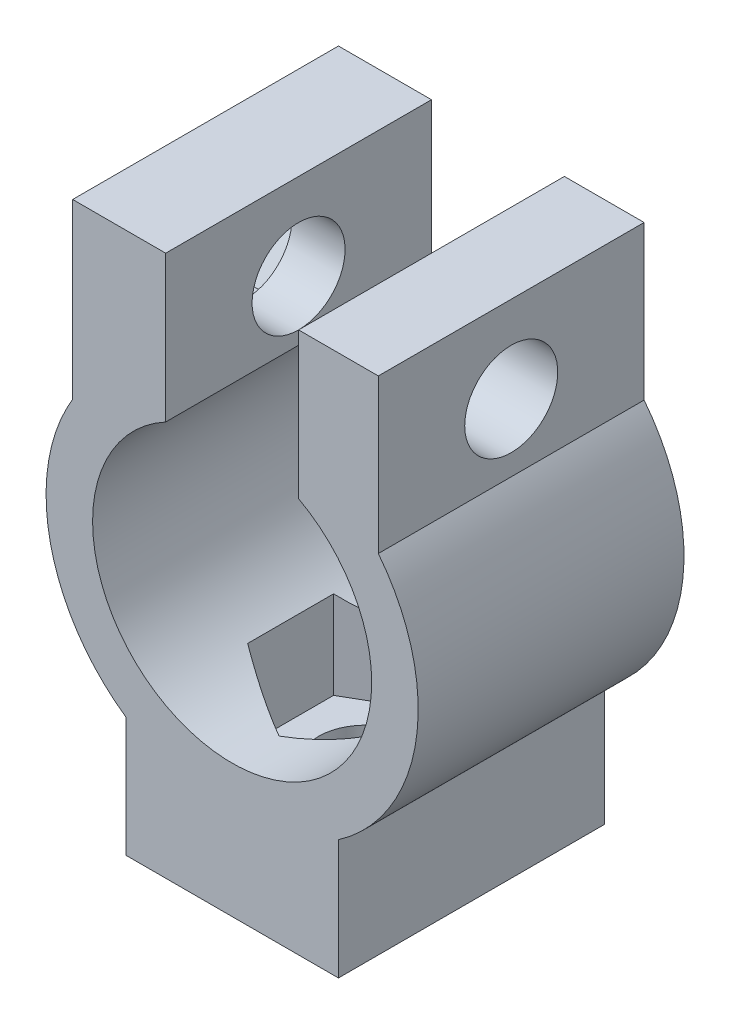
ISO-10303-21;
HEADER;
FILE_DESCRIPTION(('STEP AP214'),'2;1');
FILE_NAME('part.step','',(''),(''),'','','');
FILE_SCHEMA(('AUTOMOTIVE_DESIGN { 1 0 10303 214 1 1 1 1 }'));
ENDSEC;
DATA;
#1=APPLICATION_CONTEXT('core data for automotive mechanical design processes');
#2=APPLICATION_PROTOCOL_DEFINITION('international standard','automotive_design',2000,#1);
#3=PRODUCT_CONTEXT('',#1,'mechanical');
#4=PRODUCT('Part','Part','',(#3));
#5=PRODUCT_RELATED_PRODUCT_CATEGORY('part','',(#4));
#6=PRODUCT_DEFINITION_FORMATION('','',#4);
#7=PRODUCT_DEFINITION_CONTEXT('part definition',#1,'design');
#8=PRODUCT_DEFINITION('design','',#6,#7);
#9=PRODUCT_DEFINITION_SHAPE('','',#8);
#10=(LENGTH_UNIT() NAMED_UNIT(*) SI_UNIT(.MILLI.,.METRE.));
#11=(NAMED_UNIT(*) PLANE_ANGLE_UNIT() SI_UNIT($,.RADIAN.));
#12=(NAMED_UNIT(*) SI_UNIT($,.STERADIAN.) SOLID_ANGLE_UNIT());
#13=UNCERTAINTY_MEASURE_WITH_UNIT(LENGTH_MEASURE(1.E-05),#10,'distance_accuracy_value','');
#14=(GEOMETRIC_REPRESENTATION_CONTEXT(3) GLOBAL_UNCERTAINTY_ASSIGNED_CONTEXT((#13)) GLOBAL_UNIT_ASSIGNED_CONTEXT((#10,
#11,#12)) REPRESENTATION_CONTEXT('',''));
#15=CARTESIAN_POINT('',(0.,0.,0.));
#16=DIRECTION('',(0.,0.,1.));
#17=DIRECTION('',(1.,0.,0.));
#18=AXIS2_PLACEMENT_3D('',#15,#16,#17);
#19=CARTESIAN_POINT('',(-7.,17.1165463281549,0.));
#20=DIRECTION('',(1.,0.,0.));
#21=DIRECTION('',(0.,1.,0.));
#22=AXIS2_PLACEMENT_3D('',#19,#20,#21);
#23=CYLINDRICAL_SURFACE('',#22,1.75);
#24=CARTESIAN_POINT('',(-2.5,17.1165463281549,0.));
#25=DIRECTION('',(-1.,0.,0.));
#26=DIRECTION('',(0.,-1.,0.));
#27=AXIS2_PLACEMENT_3D('',#24,#25,#26);
#28=CIRCLE('',#27,1.75);
#29=CARTESIAN_POINT('',(-2.5,15.3665463281549,0.));
#30=VERTEX_POINT('',#29);
#31=EDGE_CURVE('E263',#30,#30,#28,.T.);
#32=ORIENTED_EDGE('',*,*,#31,.F.);
#33=EDGE_LOOP('',(#32));
#34=FACE_BOUND('',#33,.T.);
#35=CARTESIAN_POINT('',(-4.50000000000001,17.1165463281549,0.));
#36=DIRECTION('',(-1.,0.,0.));
#37=DIRECTION('',(0.,-1.,0.));
#38=AXIS2_PLACEMENT_3D('',#35,#36,#37);
#39=CIRCLE('',#38,1.75);
#40=CARTESIAN_POINT('',(-4.50000000000001,15.3665463281549,0.));
#41=VERTEX_POINT('',#40);
#42=EDGE_CURVE('E222',#41,#41,#39,.F.);
#43=ORIENTED_EDGE('',*,*,#42,.F.);
#44=EDGE_LOOP('',(#43));
#45=FACE_BOUND('',#44,.T.);
#46=ADVANCED_FACE('F35',(#34,#45),#23,.F.);
#47=CARTESIAN_POINT('',(0.,10.25,5.));
#48=DIRECTION('',(0.,0.,-1.));
#49=DIRECTION('',(-1.,0.,0.));
#50=AXIS2_PLACEMENT_3D('',#47,#48,#49);
#51=CYLINDRICAL_SURFACE('',#50,7.);
#52=CARTESIAN_POINT('',(0.,10.25,5.));
#53=DIRECTION('',(0.,0.,1.));
#54=DIRECTION('',(-1.,0.,0.));
#55=AXIS2_PLACEMENT_3D('',#52,#53,#54);
#56=CIRCLE('',#55,7.);
#57=CARTESIAN_POINT('',(-6.00000000000001,13.855551275464,5.));
#58=VERTEX_POINT('',#57);
#59=CARTESIAN_POINT('',(-4.,4.50543735346197,5.));
#60=VERTEX_POINT('',#59);
#61=EDGE_CURVE('E51',#58,#60,#56,.T.);
#62=ORIENTED_EDGE('',*,*,#61,.F.);
#63=DIRECTION('',(0.,0.,-1.));
#64=VECTOR('',#63,1.);
#65=CARTESIAN_POINT('',(-6.00000000000001,13.855551275464,5.));
#66=LINE('',#65,#64);
#67=CARTESIAN_POINT('',(-6.00000000000001,13.855551275464,-5.));
#68=VERTEX_POINT('',#67);
#69=EDGE_CURVE('E55',#58,#68,#66,.T.);
#70=ORIENTED_EDGE('',*,*,#69,.T.);
#71=CARTESIAN_POINT('',(0.,10.25,-5.));
#72=DIRECTION('',(0.,0.,1.));
#73=DIRECTION('',(-1.,0.,0.));
#74=AXIS2_PLACEMENT_3D('',#71,#72,#73);
#75=CIRCLE('',#74,7.);
#76=CARTESIAN_POINT('',(-4.,4.50543735346197,-5.));
#77=VERTEX_POINT('',#76);
#78=EDGE_CURVE('E345',#68,#77,#75,.T.);
#79=ORIENTED_EDGE('',*,*,#78,.T.);
#80=DIRECTION('',(0.,0.,-1.));
#81=VECTOR('',#80,1.);
#82=CARTESIAN_POINT('',(-4.,4.50543735346197,5.));
#83=LINE('',#82,#81);
#84=EDGE_CURVE('E355',#60,#77,#83,.T.);
#85=ORIENTED_EDGE('',*,*,#84,.F.);
#86=EDGE_LOOP('',(#62,#70,#79,#85));
#87=FACE_BOUND('',#86,.T.);
#88=ADVANCED_FACE('F434',(#87),#51,.T.);
#89=CARTESIAN_POINT('',(4.,0.,5.));
#90=DIRECTION('',(-1.,0.,0.));
#91=DIRECTION('',(0.,0.,1.));
#92=AXIS2_PLACEMENT_3D('',#89,#90,#91);
#93=PLANE('',#92);
#94=DIRECTION('',(0.,1.,0.));
#95=VECTOR('',#94,1.);
#96=CARTESIAN_POINT('',(4.,0.,-5.));
#97=LINE('',#96,#95);
#98=CARTESIAN_POINT('',(4.,0.,-5.));
#99=VERTEX_POINT('',#98);
#100=CARTESIAN_POINT('',(4.,4.50543735346197,-5.));
#101=VERTEX_POINT('',#100);
#102=EDGE_CURVE('E304',#99,#101,#97,.T.);
#103=ORIENTED_EDGE('',*,*,#102,.T.);
#104=DIRECTION('',(0.,0.,-1.));
#105=VECTOR('',#104,1.);
#106=CARTESIAN_POINT('',(4.,4.50543735346197,5.));
#107=LINE('',#106,#105);
#108=CARTESIAN_POINT('',(4.,4.50543735346197,5.));
#109=VERTEX_POINT('',#108);
#110=EDGE_CURVE('E376',#109,#101,#107,.T.);
#111=ORIENTED_EDGE('',*,*,#110,.F.);
#112=DIRECTION('',(0.,1.,0.));
#113=VECTOR('',#112,1.);
#114=CARTESIAN_POINT('',(4.,0.,5.));
#115=LINE('',#114,#113);
#116=CARTESIAN_POINT('',(4.,0.,5.));
#117=VERTEX_POINT('',#116);
#118=EDGE_CURVE('E305',#117,#109,#115,.T.);
#119=ORIENTED_EDGE('',*,*,#118,.F.);
#120=DIRECTION('',(0.,0.,-1.));
#121=VECTOR('',#120,1.);
#122=CARTESIAN_POINT('',(4.,0.,5.));
#123=LINE('',#122,#121);
#124=EDGE_CURVE('E328',#117,#99,#123,.T.);
#125=ORIENTED_EDGE('',*,*,#124,.T.);
#126=EDGE_LOOP('',(#103,#111,#119,#125));
#127=FACE_BOUND('',#126,.T.);
#128=ADVANCED_FACE('F37',(#127),#93,.F.);
#129=CARTESIAN_POINT('',(0.,10.25,5.));
#130=DIRECTION('',(0.,0.,-1.));
#131=DIRECTION('',(-1.,0.,0.));
#132=AXIS2_PLACEMENT_3D('',#129,#130,#131);
#133=CYLINDRICAL_SURFACE('',#132,7.);
#134=CARTESIAN_POINT('',(0.,10.25,-5.));
#135=DIRECTION('',(0.,0.,1.));
#136=DIRECTION('',(1.,0.,0.));
#137=AXIS2_PLACEMENT_3D('',#134,#135,#136);
#138=CIRCLE('',#137,7.);
#139=CARTESIAN_POINT('',(5.5,14.5801270189222,-5.));
#140=VERTEX_POINT('',#139);
#141=EDGE_CURVE('E331',#101,#140,#138,.T.);
#142=ORIENTED_EDGE('',*,*,#141,.T.);
#143=DIRECTION('',(0.,0.,-1.));
#144=VECTOR('',#143,1.);
#145=CARTESIAN_POINT('',(5.5,14.5801270189222,5.));
#146=LINE('',#145,#144);
#147=CARTESIAN_POINT('',(5.5,14.5801270189222,5.));
#148=VERTEX_POINT('',#147);
#149=EDGE_CURVE('E373',#148,#140,#146,.T.);
#150=ORIENTED_EDGE('',*,*,#149,.F.);
#151=CARTESIAN_POINT('',(0.,10.25,5.));
#152=DIRECTION('',(0.,0.,1.));
#153=DIRECTION('',(1.,0.,0.));
#154=AXIS2_PLACEMENT_3D('',#151,#152,#153);
#155=CIRCLE('',#154,7.);
#156=EDGE_CURVE('E308',#109,#148,#155,.T.);
#157=ORIENTED_EDGE('',*,*,#156,.F.);
#158=ORIENTED_EDGE('',*,*,#110,.T.);
#159=EDGE_LOOP('',(#142,#150,#157,#158));
#160=FACE_BOUND('',#159,.T.);
#161=ADVANCED_FACE('F463',(#160),#133,.T.);
#162=CARTESIAN_POINT('',(5.5,20.3665463281549,5.));
#163=DIRECTION('',(-1.,0.,0.));
#164=DIRECTION('',(0.,0.,1.));
#165=AXIS2_PLACEMENT_3D('',#162,#163,#164);
#166=PLANE('',#165);
#167=CARTESIAN_POINT('',(5.5,17.1165463281549,0.));
#168=DIRECTION('',(-1.,0.,0.));
#169=DIRECTION('',(0.,0.,1.));
#170=AXIS2_PLACEMENT_3D('',#167,#168,#169);
#171=CIRCLE('',#170,1.75);
#172=CARTESIAN_POINT('',(5.5,17.1165463281549,1.75));
#173=VERTEX_POINT('',#172);
#174=EDGE_CURVE('E269',#173,#173,#171,.T.);
#175=ORIENTED_EDGE('',*,*,#174,.T.);
#176=EDGE_LOOP('',(#175));
#177=FACE_BOUND('',#176,.T.);
#178=DIRECTION('',(0.,1.,0.));
#179=VECTOR('',#178,1.);
#180=CARTESIAN_POINT('',(5.5,20.3665463281549,-5.));
#181=LINE('',#180,#179);
#182=CARTESIAN_POINT('',(5.5,20.3665463281549,-5.));
#183=VERTEX_POINT('',#182);
#184=EDGE_CURVE('E333',#140,#183,#181,.T.);
#185=ORIENTED_EDGE('',*,*,#184,.T.);
#186=DIRECTION('',(0.,0.,-1.));
#187=VECTOR('',#186,1.);
#188=CARTESIAN_POINT('',(5.5,20.3665463281549,5.));
#189=LINE('',#188,#187);
#190=CARTESIAN_POINT('',(5.5,20.3665463281549,5.));
#191=VERTEX_POINT('',#190);
#192=EDGE_CURVE('E370',#191,#183,#189,.T.);
#193=ORIENTED_EDGE('',*,*,#192,.F.);
#194=DIRECTION('',(0.,1.,0.));
#195=VECTOR('',#194,1.);
#196=CARTESIAN_POINT('',(5.5,20.3665463281549,5.));
#197=LINE('',#196,#195);
#198=EDGE_CURVE('E311',#148,#191,#197,.T.);
#199=ORIENTED_EDGE('',*,*,#198,.F.);
#200=ORIENTED_EDGE('',*,*,#149,.T.);
#201=EDGE_LOOP('',(#185,#193,#199,#200));
#202=FACE_BOUND('',#201,.T.);
#203=ADVANCED_FACE('F459',(#177,#202),#166,.F.);
#204=CARTESIAN_POINT('',(2.5,20.3665463281549,5.));
#205=DIRECTION('',(0.,-1.,0.));
#206=DIRECTION('',(0.,0.,-1.));
#207=AXIS2_PLACEMENT_3D('',#204,#205,#206);
#208=PLANE('',#207);
#209=DIRECTION('',(-1.,0.,0.));
#210=VECTOR('',#209,1.);
#211=CARTESIAN_POINT('',(2.5,20.3665463281549,-5.));
#212=LINE('',#211,#210);
#213=CARTESIAN_POINT('',(2.5,20.3665463281549,-5.));
#214=VERTEX_POINT('',#213);
#215=EDGE_CURVE('E335',#183,#214,#212,.T.);
#216=ORIENTED_EDGE('',*,*,#215,.T.);
#217=DIRECTION('',(0.,0.,-1.));
#218=VECTOR('',#217,1.);
#219=CARTESIAN_POINT('',(2.5,20.3665463281549,5.));
#220=LINE('',#219,#218);
#221=CARTESIAN_POINT('',(2.5,20.3665463281549,5.));
#222=VERTEX_POINT('',#221);
#223=EDGE_CURVE('E367',#222,#214,#220,.T.);
#224=ORIENTED_EDGE('',*,*,#223,.F.);
#225=DIRECTION('',(-1.,0.,0.));
#226=VECTOR('',#225,1.);
#227=CARTESIAN_POINT('',(2.5,20.3665463281549,5.));
#228=LINE('',#227,#226);
#229=EDGE_CURVE('E313',#191,#222,#228,.T.);
#230=ORIENTED_EDGE('',*,*,#229,.F.);
#231=ORIENTED_EDGE('',*,*,#192,.T.);
#232=EDGE_LOOP('',(#216,#224,#230,#231));
#233=FACE_BOUND('',#232,.T.);
#234=ADVANCED_FACE('F462',(#233),#208,.F.);
#235=CARTESIAN_POINT('',(2.5,14.8665463281548,5.));
#236=DIRECTION('',(1.,0.,0.));
#237=DIRECTION('',(0.,1.,0.));
#238=AXIS2_PLACEMENT_3D('',#235,#236,#237);
#239=PLANE('',#238);
#240=CARTESIAN_POINT('',(2.5,17.1165463281549,0.));
#241=DIRECTION('',(1.,0.,0.));
#242=DIRECTION('',(0.,1.,0.));
#243=AXIS2_PLACEMENT_3D('',#240,#241,#242);
#244=CIRCLE('',#243,1.75);
#245=CARTESIAN_POINT('',(2.5,18.8665463281549,0.));
#246=VERTEX_POINT('',#245);
#247=EDGE_CURVE('E266',#246,#246,#244,.T.);
#248=ORIENTED_EDGE('',*,*,#247,.T.);
#249=EDGE_LOOP('',(#248));
#250=FACE_BOUND('',#249,.T.);
#251=DIRECTION('',(0.,-1.,0.));
#252=VECTOR('',#251,1.);
#253=CARTESIAN_POINT('',(2.5,14.8665463281548,-5.));
#254=LINE('',#253,#252);
#255=CARTESIAN_POINT('',(2.5,14.8665463281548,-5.));
#256=VERTEX_POINT('',#255);
#257=EDGE_CURVE('E337',#214,#256,#254,.T.);
#258=ORIENTED_EDGE('',*,*,#257,.T.);
#259=DIRECTION('',(0.,0.,-1.));
#260=VECTOR('',#259,1.);
#261=CARTESIAN_POINT('',(2.5,14.8665463281548,5.));
#262=LINE('',#261,#260);
#263=CARTESIAN_POINT('',(2.5,14.8665463281548,5.));
#264=VERTEX_POINT('',#263);
#265=EDGE_CURVE('E364',#264,#256,#262,.T.);
#266=ORIENTED_EDGE('',*,*,#265,.F.);
#267=DIRECTION('',(0.,-1.,0.));
#268=VECTOR('',#267,1.);
#269=CARTESIAN_POINT('',(2.5,14.8665463281548,5.));
#270=LINE('',#269,#268);
#271=EDGE_CURVE('E315',#222,#264,#270,.T.);
#272=ORIENTED_EDGE('',*,*,#271,.F.);
#273=ORIENTED_EDGE('',*,*,#223,.T.);
#274=EDGE_LOOP('',(#258,#266,#272,#273));
#275=FACE_BOUND('',#274,.T.);
#276=ADVANCED_FACE('F480',(#250,#275),#239,.F.);
#277=CARTESIAN_POINT('',(0.,10.25,5.));
#278=DIRECTION('',(0.,0.,-1.));
#279=DIRECTION('',(-1.,0.,0.));
#280=AXIS2_PLACEMENT_3D('',#277,#278,#279);
#281=CYLINDRICAL_SURFACE('',#280,5.25);
#282=CARTESIAN_POINT('',(0.,10.25,-3.2331615074619));
#283=DIRECTION('',(-0.5,0.,-0.866025403784439));
#284=DIRECTION('',(0.866025403784439,0.,-0.5));
#285=AXIS2_PLACEMENT_3D('',#282,#283,#284);
#286=ELLIPSE('',#285,6.06217782649107,5.25);
#287=CARTESIAN_POINT('',(-2.79999999999998,5.80899786084265,-1.61658075373095));
#288=VERTEX_POINT('',#287);
#289=CARTESIAN_POINT('',(0.,4.99999999999999,-3.2331615074619));
#290=VERTEX_POINT('',#289);
#291=EDGE_CURVE('E379',#288,#290,#286,.F.);
#292=ORIENTED_EDGE('',*,*,#291,.T.);
#293=CARTESIAN_POINT('',(0.,10.25,-3.23316150746191));
#294=DIRECTION('',(0.5,0.,-0.866025403784439));
#295=DIRECTION('',(-0.866025403784439,0.,-0.5));
#296=AXIS2_PLACEMENT_3D('',#293,#294,#295);
#297=ELLIPSE('',#296,6.06217782649107,5.25);
#298=CARTESIAN_POINT('',(2.80000000000002,5.80899786084268,-1.61658075373095));
#299=VERTEX_POINT('',#298);
#300=EDGE_CURVE('E12',#290,#299,#297,.F.);
#301=ORIENTED_EDGE('',*,*,#300,.T.);
#302=DIRECTION('',(0.,0.,-1.));
#303=VECTOR('',#302,1.);
#304=CARTESIAN_POINT('',(2.80000000000002,5.80899786084268,5.));
#305=LINE('',#304,#303);
#306=CARTESIAN_POINT('',(2.80000000000002,5.80899786084268,1.61658075373095));
#307=VERTEX_POINT('',#306);
#308=EDGE_CURVE('E44',#299,#307,#305,.F.);
#309=ORIENTED_EDGE('',*,*,#308,.T.);
#310=CARTESIAN_POINT('',(0.,10.25,3.23316150746191));
#311=DIRECTION('',(0.5,0.,0.866025403784439));
#312=DIRECTION('',(0.866025403784439,0.,-0.5));
#313=AXIS2_PLACEMENT_3D('',#310,#311,#312);
#314=ELLIPSE('',#313,6.06217782649107,5.25);
#315=CARTESIAN_POINT('',(0.,5.,3.2331615074619));
#316=VERTEX_POINT('',#315);
#317=EDGE_CURVE('E388',#307,#316,#314,.F.);
#318=ORIENTED_EDGE('',*,*,#317,.T.);
#319=CARTESIAN_POINT('',(0.,10.25,3.2331615074619));
#320=DIRECTION('',(-0.5,0.,0.866025403784439));
#321=DIRECTION('',(-0.866025403784439,0.,-0.5));
#322=AXIS2_PLACEMENT_3D('',#319,#320,#321);
#323=ELLIPSE('',#322,6.06217782649107,5.25);
#324=CARTESIAN_POINT('',(-2.79999999999998,5.80899786084266,1.61658075373095));
#325=VERTEX_POINT('',#324);
#326=EDGE_CURVE('E385',#316,#325,#323,.F.);
#327=ORIENTED_EDGE('',*,*,#326,.T.);
#328=DIRECTION('',(0.,0.,-1.));
#329=VECTOR('',#328,1.);
#330=CARTESIAN_POINT('',(-2.79999999999998,5.80899786084266,5.));
#331=LINE('',#330,#329);
#332=EDGE_CURVE('E382',#325,#288,#331,.T.);
#333=ORIENTED_EDGE('',*,*,#332,.T.);
#334=EDGE_LOOP('',(#292,#301,#309,#318,#327,#333));
#335=FACE_BOUND('',#334,.T.);
#336=CARTESIAN_POINT('',(0.,10.25,-5.));
#337=DIRECTION('',(0.,0.,-1.));
#338=DIRECTION('',(1.,0.,0.));
#339=AXIS2_PLACEMENT_3D('',#336,#337,#338);
#340=CIRCLE('',#339,5.25);
#341=CARTESIAN_POINT('',(-2.5,14.8665463281548,-5.));
#342=VERTEX_POINT('',#341);
#343=EDGE_CURVE('E339',#256,#342,#340,.T.);
#344=ORIENTED_EDGE('',*,*,#343,.T.);
#345=DIRECTION('',(0.,0.,-1.));
#346=VECTOR('',#345,1.);
#347=CARTESIAN_POINT('',(-2.5,14.8665463281548,5.));
#348=LINE('',#347,#346);
#349=CARTESIAN_POINT('',(-2.5,14.8665463281548,5.));
#350=VERTEX_POINT('',#349);
#351=EDGE_CURVE('E361',#350,#342,#348,.T.);
#352=ORIENTED_EDGE('',*,*,#351,.F.);
#353=CARTESIAN_POINT('',(0.,10.25,5.));
#354=DIRECTION('',(0.,0.,-1.));
#355=DIRECTION('',(1.,0.,0.));
#356=AXIS2_PLACEMENT_3D('',#353,#354,#355);
#357=CIRCLE('',#356,5.25);
#358=EDGE_CURVE('E317',#264,#350,#357,.T.);
#359=ORIENTED_EDGE('',*,*,#358,.F.);
#360=ORIENTED_EDGE('',*,*,#265,.T.);
#361=EDGE_LOOP('',(#344,#352,#359,#360));
#362=FACE_BOUND('',#361,.T.);
#363=ADVANCED_FACE('F393',(#335,#362),#281,.F.);
#364=CARTESIAN_POINT('',(-2.5,14.8665463281548,5.));
#365=DIRECTION('',(-1.,0.,0.));
#366=DIRECTION('',(0.,-1.,0.));
#367=AXIS2_PLACEMENT_3D('',#364,#365,#366);
#368=PLANE('',#367);
#369=ORIENTED_EDGE('',*,*,#31,.T.);
#370=EDGE_LOOP('',(#369));
#371=FACE_BOUND('',#370,.T.);
#372=DIRECTION('',(0.,1.,0.));
#373=VECTOR('',#372,1.);
#374=CARTESIAN_POINT('',(-2.5,14.8665463281548,-5.));
#375=LINE('',#374,#373);
#376=CARTESIAN_POINT('',(-2.5,20.3665463281549,-5.));
#377=VERTEX_POINT('',#376);
#378=EDGE_CURVE('E341',#342,#377,#375,.T.);
#379=ORIENTED_EDGE('',*,*,#378,.T.);
#380=DIRECTION('',(0.,0.,-1.));
#381=VECTOR('',#380,1.);
#382=CARTESIAN_POINT('',(-2.5,20.3665463281549,5.));
#383=LINE('',#382,#381);
#384=CARTESIAN_POINT('',(-2.5,20.3665463281549,5.));
#385=VERTEX_POINT('',#384);
#386=EDGE_CURVE('E358',#385,#377,#383,.T.);
#387=ORIENTED_EDGE('',*,*,#386,.F.);
#388=DIRECTION('',(0.,1.,0.));
#389=VECTOR('',#388,1.);
#390=CARTESIAN_POINT('',(-2.5,14.8665463281548,5.));
#391=LINE('',#390,#389);
#392=EDGE_CURVE('E319',#350,#385,#391,.T.);
#393=ORIENTED_EDGE('',*,*,#392,.F.);
#394=ORIENTED_EDGE('',*,*,#351,.T.);
#395=EDGE_LOOP('',(#379,#387,#393,#394));
#396=FACE_BOUND('',#395,.T.);
#397=ADVANCED_FACE('F512',(#371,#396),#368,.F.);
#398=CARTESIAN_POINT('',(-2.5,20.3665463281549,5.));
#399=DIRECTION('',(0.,-1.,0.));
#400=DIRECTION('',(0.,0.,-1.));
#401=AXIS2_PLACEMENT_3D('',#398,#399,#400);
#402=PLANE('',#401);
#403=DIRECTION('',(-1.,0.,0.));
#404=VECTOR('',#403,1.);
#405=CARTESIAN_POINT('',(-2.5,20.3665463281549,-5.));
#406=LINE('',#405,#404);
#407=CARTESIAN_POINT('',(-6.00000000000001,20.3665463281548,-5.));
#408=VERTEX_POINT('',#407);
#409=EDGE_CURVE('E343',#377,#408,#406,.T.);
#410=ORIENTED_EDGE('',*,*,#409,.T.);
#411=DIRECTION('',(0.,0.,-1.));
#412=VECTOR('',#411,1.);
#413=CARTESIAN_POINT('',(-6.00000000000001,20.3665463281548,-5.));
#414=LINE('',#413,#412);
#415=CARTESIAN_POINT('',(-6.00000000000001,20.3665463281548,5.));
#416=VERTEX_POINT('',#415);
#417=EDGE_CURVE('E259',#416,#408,#414,.T.);
#418=ORIENTED_EDGE('',*,*,#417,.F.);
#419=DIRECTION('',(-1.,0.,0.));
#420=VECTOR('',#419,1.);
#421=CARTESIAN_POINT('',(-2.5,20.3665463281549,5.));
#422=LINE('',#421,#420);
#423=EDGE_CURVE('E321',#385,#416,#422,.T.);
#424=ORIENTED_EDGE('',*,*,#423,.F.);
#425=ORIENTED_EDGE('',*,*,#386,.T.);
#426=EDGE_LOOP('',(#410,#418,#424,#425));
#427=FACE_BOUND('',#426,.T.);
#428=ADVANCED_FACE('F510',(#427),#402,.F.);
#429=CARTESIAN_POINT('',(-4.,0.,5.));
#430=DIRECTION('',(1.,0.,0.));
#431=DIRECTION('',(0.,0.,-1.));
#432=AXIS2_PLACEMENT_3D('',#429,#430,#431);
#433=PLANE('',#432);
#434=DIRECTION('',(0.,-1.,0.));
#435=VECTOR('',#434,1.);
#436=CARTESIAN_POINT('',(-4.,0.,-5.));
#437=LINE('',#436,#435);
#438=CARTESIAN_POINT('',(-4.,0.,-5.));
#439=VERTEX_POINT('',#438);
#440=EDGE_CURVE('E347',#77,#439,#437,.T.);
#441=ORIENTED_EDGE('',*,*,#440,.T.);
#442=DIRECTION('',(0.,0.,-1.));
#443=VECTOR('',#442,1.);
#444=CARTESIAN_POINT('',(-4.,0.,5.));
#445=LINE('',#444,#443);
#446=CARTESIAN_POINT('',(-4.,0.,5.));
#447=VERTEX_POINT('',#446);
#448=EDGE_CURVE('E352',#447,#439,#445,.T.);
#449=ORIENTED_EDGE('',*,*,#448,.F.);
#450=DIRECTION('',(0.,-1.,0.));
#451=VECTOR('',#450,1.);
#452=CARTESIAN_POINT('',(-4.,0.,5.));
#453=LINE('',#452,#451);
#454=EDGE_CURVE('E324',#60,#447,#453,.T.);
#455=ORIENTED_EDGE('',*,*,#454,.F.);
#456=ORIENTED_EDGE('',*,*,#84,.T.);
#457=EDGE_LOOP('',(#441,#449,#455,#456));
#458=FACE_BOUND('',#457,.T.);
#459=ADVANCED_FACE('F503',(#458),#433,.F.);
#460=CARTESIAN_POINT('',(-4.,0.,5.));
#461=DIRECTION('',(0.,1.,0.));
#462=DIRECTION('',(0.,0.,1.));
#463=AXIS2_PLACEMENT_3D('',#460,#461,#462);
#464=PLANE('',#463);
#465=CARTESIAN_POINT('',(0.,0.,0.));
#466=DIRECTION('',(0.,1.,0.));
#467=DIRECTION('',(-1.,0.,0.));
#468=AXIS2_PLACEMENT_3D('',#465,#466,#467);
#469=CIRCLE('',#468,1.75);
#470=CARTESIAN_POINT('',(-1.74999999999997,0.,0.));
#471=VERTEX_POINT('',#470);
#472=EDGE_CURVE('E272',#471,#471,#469,.T.);
#473=ORIENTED_EDGE('',*,*,#472,.T.);
#474=EDGE_LOOP('',(#473));
#475=FACE_BOUND('',#474,.T.);
#476=DIRECTION('',(1.,0.,0.));
#477=VECTOR('',#476,1.);
#478=CARTESIAN_POINT('',(-4.,0.,-5.));
#479=LINE('',#478,#477);
#480=EDGE_CURVE('E309',#439,#99,#479,.T.);
#481=ORIENTED_EDGE('',*,*,#480,.T.);
#482=ORIENTED_EDGE('',*,*,#124,.F.);
#483=DIRECTION('',(1.,0.,0.));
#484=VECTOR('',#483,1.);
#485=CARTESIAN_POINT('',(-4.,0.,5.));
#486=LINE('',#485,#484);
#487=EDGE_CURVE('E326',#447,#117,#486,.T.);
#488=ORIENTED_EDGE('',*,*,#487,.F.);
#489=ORIENTED_EDGE('',*,*,#448,.T.);
#490=EDGE_LOOP('',(#481,#482,#488,#489));
#491=FACE_BOUND('',#490,.T.);
#492=ADVANCED_FACE('F499',(#475,#491),#464,.F.);
#493=CARTESIAN_POINT('',(0.,10.25,5.));
#494=DIRECTION('',(0.,0.,1.));
#495=DIRECTION('',(1.,0.,0.));
#496=AXIS2_PLACEMENT_3D('',#493,#494,#495);
#497=PLANE('',#496);
#498=DIRECTION('',(0.,1.,0.));
#499=VECTOR('',#498,1.);
#500=CARTESIAN_POINT('',(-6.00000000000001,20.3665463281548,5.));
#501=LINE('',#500,#499);
#502=EDGE_CURVE('E256',#58,#416,#501,.T.);
#503=ORIENTED_EDGE('',*,*,#502,.F.);
#504=ORIENTED_EDGE('',*,*,#61,.T.);
#505=ORIENTED_EDGE('',*,*,#454,.T.);
#506=ORIENTED_EDGE('',*,*,#487,.T.);
#507=ORIENTED_EDGE('',*,*,#118,.T.);
#508=ORIENTED_EDGE('',*,*,#156,.T.);
#509=ORIENTED_EDGE('',*,*,#198,.T.);
#510=ORIENTED_EDGE('',*,*,#229,.T.);
#511=ORIENTED_EDGE('',*,*,#271,.T.);
#512=ORIENTED_EDGE('',*,*,#358,.T.);
#513=ORIENTED_EDGE('',*,*,#392,.T.);
#514=ORIENTED_EDGE('',*,*,#423,.T.);
#515=EDGE_LOOP('',(#503,#504,#505,#506,#507,#508,#509,#510,#511,#512,#513,#514));
#516=FACE_BOUND('',#515,.T.);
#517=ADVANCED_FACE('F487',(#516),#497,.T.);
#518=CARTESIAN_POINT('',(0.,10.25,-5.));
#519=DIRECTION('',(0.,0.,1.));
#520=DIRECTION('',(1.,0.,0.));
#521=AXIS2_PLACEMENT_3D('',#518,#519,#520);
#522=PLANE('',#521);
#523=ORIENTED_EDGE('',*,*,#78,.F.);
#524=DIRECTION('',(0.,-1.,0.));
#525=VECTOR('',#524,1.);
#526=CARTESIAN_POINT('',(-6.00000000000001,20.3665463281548,-5.));
#527=LINE('',#526,#525);
#528=EDGE_CURVE('E253',#408,#68,#527,.T.);
#529=ORIENTED_EDGE('',*,*,#528,.F.);
#530=ORIENTED_EDGE('',*,*,#409,.F.);
#531=ORIENTED_EDGE('',*,*,#378,.F.);
#532=ORIENTED_EDGE('',*,*,#343,.F.);
#533=ORIENTED_EDGE('',*,*,#257,.F.);
#534=ORIENTED_EDGE('',*,*,#215,.F.);
#535=ORIENTED_EDGE('',*,*,#184,.F.);
#536=ORIENTED_EDGE('',*,*,#141,.F.);
#537=ORIENTED_EDGE('',*,*,#102,.F.);
#538=ORIENTED_EDGE('',*,*,#480,.F.);
#539=ORIENTED_EDGE('',*,*,#440,.F.);
#540=EDGE_LOOP('',(#523,#529,#530,#531,#532,#533,#534,#535,#536,#537,#538,#539));
#541=FACE_BOUND('',#540,.T.);
#542=ADVANCED_FACE('F475',(#541),#522,.F.);
#543=CARTESIAN_POINT('',(2.80000000000004,-8.5541412972509,-1.61658075373095));
#544=DIRECTION('',(0.5,0.,-0.866025403784439));
#545=DIRECTION('',(-0.866025403784439,0.,-0.5));
#546=AXIS2_PLACEMENT_3D('',#543,#544,#545);
#547=PLANE('',#546);
#548=DIRECTION('',(0.,1.,0.));
#549=VECTOR('',#548,1.);
#550=CARTESIAN_POINT('',(0.,-8.5541412972509,-3.2331615074619));
#551=LINE('',#550,#549);
#552=CARTESIAN_POINT('',(0.,2.5,-3.23316150746191));
#553=VERTEX_POINT('',#552);
#554=EDGE_CURVE('E301',#553,#290,#551,.T.);
#555=ORIENTED_EDGE('',*,*,#554,.F.);
#556=DIRECTION('',(0.866025403784439,0.,0.5));
#557=VECTOR('',#556,1.);
#558=CARTESIAN_POINT('',(2.80000000000003,2.5,-1.61658075373095));
#559=LINE('',#558,#557);
#560=CARTESIAN_POINT('',(2.80000000000002,2.5,-1.61658075373095));
#561=VERTEX_POINT('',#560);
#562=EDGE_CURVE('E284',#553,#561,#559,.T.);
#563=ORIENTED_EDGE('',*,*,#562,.T.);
#564=DIRECTION('',(0.,1.,0.));
#565=VECTOR('',#564,1.);
#566=CARTESIAN_POINT('',(2.80000000000004,-8.5541412972509,-1.61658075373095));
#567=LINE('',#566,#565);
#568=EDGE_CURVE('E278',#561,#299,#567,.T.);
#569=ORIENTED_EDGE('',*,*,#568,.T.);
#570=ORIENTED_EDGE('',*,*,#300,.F.);
#571=EDGE_LOOP('',(#555,#563,#569,#570));
#572=FACE_BOUND('',#571,.T.);
#573=ADVANCED_FACE('F402',(#572),#547,.F.);
#574=CARTESIAN_POINT('',(2.80000000000004,-8.5541412972509,1.61658075373095));
#575=DIRECTION('',(1.,0.,0.));
#576=DIRECTION('',(0.,1.,0.));
#577=AXIS2_PLACEMENT_3D('',#574,#575,#576);
#578=PLANE('',#577);
#579=ORIENTED_EDGE('',*,*,#568,.F.);
#580=DIRECTION('',(0.,0.,1.));
#581=VECTOR('',#580,1.);
#582=CARTESIAN_POINT('',(2.80000000000003,2.5,1.61658075373095));
#583=LINE('',#582,#581);
#584=CARTESIAN_POINT('',(2.80000000000004,2.5,1.61658075373094));
#585=VERTEX_POINT('',#584);
#586=EDGE_CURVE('E282',#561,#585,#583,.T.);
#587=ORIENTED_EDGE('',*,*,#586,.T.);
#588=DIRECTION('',(0.,1.,0.));
#589=VECTOR('',#588,1.);
#590=CARTESIAN_POINT('',(2.80000000000004,-8.5541412972509,1.61658075373095));
#591=LINE('',#590,#589);
#592=EDGE_CURVE('E289',#585,#307,#591,.T.);
#593=ORIENTED_EDGE('',*,*,#592,.T.);
#594=ORIENTED_EDGE('',*,*,#308,.F.);
#595=EDGE_LOOP('',(#579,#587,#593,#594));
#596=FACE_BOUND('',#595,.T.);
#597=ADVANCED_FACE('F398',(#596),#578,.F.);
#598=CARTESIAN_POINT('',(0.,-8.5541412972509,3.2331615074619));
#599=DIRECTION('',(0.5,0.,0.866025403784439));
#600=DIRECTION('',(0.866025403784439,0.,-0.5));
#601=AXIS2_PLACEMENT_3D('',#598,#599,#600);
#602=PLANE('',#601);
#603=ORIENTED_EDGE('',*,*,#592,.F.);
#604=DIRECTION('',(-0.866025403784439,0.,0.5));
#605=VECTOR('',#604,1.);
#606=CARTESIAN_POINT('',(0.,2.5,3.2331615074619));
#607=LINE('',#606,#605);
#608=CARTESIAN_POINT('',(0.,2.5,3.23316150746191));
#609=VERTEX_POINT('',#608);
#610=EDGE_CURVE('E280',#585,#609,#607,.T.);
#611=ORIENTED_EDGE('',*,*,#610,.T.);
#612=DIRECTION('',(0.,1.,0.));
#613=VECTOR('',#612,1.);
#614=CARTESIAN_POINT('',(0.,-8.5541412972509,3.2331615074619));
#615=LINE('',#614,#613);
#616=EDGE_CURVE('E292',#609,#316,#615,.T.);
#617=ORIENTED_EDGE('',*,*,#616,.T.);
#618=ORIENTED_EDGE('',*,*,#317,.F.);
#619=EDGE_LOOP('',(#603,#611,#617,#618));
#620=FACE_BOUND('',#619,.T.);
#621=ADVANCED_FACE('F413',(#620),#602,.F.);
#622=CARTESIAN_POINT('',(-2.79999999999996,-8.5541412972509,1.61658075373095));
#623=DIRECTION('',(-0.5,0.,0.866025403784439));
#624=DIRECTION('',(0.866025403784439,0.,0.5));
#625=AXIS2_PLACEMENT_3D('',#622,#623,#624);
#626=PLANE('',#625);
#627=ORIENTED_EDGE('',*,*,#616,.F.);
#628=DIRECTION('',(-0.866025403784439,0.,-0.5));
#629=VECTOR('',#628,1.);
#630=CARTESIAN_POINT('',(-2.79999999999996,2.5,1.61658075373096));
#631=LINE('',#630,#629);
#632=CARTESIAN_POINT('',(-2.79999999999997,2.5,1.61658075373095));
#633=VERTEX_POINT('',#632);
#634=EDGE_CURVE('E277',#609,#633,#631,.T.);
#635=ORIENTED_EDGE('',*,*,#634,.T.);
#636=DIRECTION('',(0.,1.,0.));
#637=VECTOR('',#636,1.);
#638=CARTESIAN_POINT('',(-2.79999999999996,-8.5541412972509,1.61658075373095));
#639=LINE('',#638,#637);
#640=EDGE_CURVE('E295',#633,#325,#639,.T.);
#641=ORIENTED_EDGE('',*,*,#640,.T.);
#642=ORIENTED_EDGE('',*,*,#326,.F.);
#643=EDGE_LOOP('',(#627,#635,#641,#642));
#644=FACE_BOUND('',#643,.T.);
#645=ADVANCED_FACE('F415',(#644),#626,.F.);
#646=CARTESIAN_POINT('',(-2.79999999999996,-8.5541412972509,-1.61658075373095));
#647=DIRECTION('',(-1.,0.,0.));
#648=DIRECTION('',(0.,-1.,0.));
#649=AXIS2_PLACEMENT_3D('',#646,#647,#648);
#650=PLANE('',#649);
#651=ORIENTED_EDGE('',*,*,#640,.F.);
#652=DIRECTION('',(0.,0.,-1.));
#653=VECTOR('',#652,1.);
#654=CARTESIAN_POINT('',(-2.79999999999998,2.5,-1.61658075373095));
#655=LINE('',#654,#653);
#656=CARTESIAN_POINT('',(-2.79999999999998,2.5,-1.61658075373095));
#657=VERTEX_POINT('',#656);
#658=EDGE_CURVE('E275',#633,#657,#655,.T.);
#659=ORIENTED_EDGE('',*,*,#658,.T.);
#660=DIRECTION('',(0.,1.,0.));
#661=VECTOR('',#660,1.);
#662=CARTESIAN_POINT('',(-2.79999999999996,-8.5541412972509,-1.61658075373095));
#663=LINE('',#662,#661);
#664=EDGE_CURVE('E298',#657,#288,#663,.T.);
#665=ORIENTED_EDGE('',*,*,#664,.T.);
#666=ORIENTED_EDGE('',*,*,#332,.F.);
#667=EDGE_LOOP('',(#651,#659,#665,#666));
#668=FACE_BOUND('',#667,.T.);
#669=ADVANCED_FACE('F418',(#668),#650,.F.);
#670=CARTESIAN_POINT('',(0.,-8.5541412972509,-3.2331615074619));
#671=DIRECTION('',(-0.5,0.,-0.866025403784439));
#672=DIRECTION('',(-0.866025403784439,0.,0.5));
#673=AXIS2_PLACEMENT_3D('',#670,#671,#672);
#674=PLANE('',#673);
#675=ORIENTED_EDGE('',*,*,#664,.F.);
#676=DIRECTION('',(0.866025403784439,0.,-0.5));
#677=VECTOR('',#676,1.);
#678=CARTESIAN_POINT('',(0.,2.5,-3.23316150746191));
#679=LINE('',#678,#677);
#680=EDGE_CURVE('E286',#657,#553,#679,.T.);
#681=ORIENTED_EDGE('',*,*,#680,.T.);
#682=ORIENTED_EDGE('',*,*,#554,.T.);
#683=ORIENTED_EDGE('',*,*,#291,.F.);
#684=EDGE_LOOP('',(#675,#681,#682,#683));
#685=FACE_BOUND('',#684,.T.);
#686=ADVANCED_FACE('F421',(#685),#674,.F.);
#687=CARTESIAN_POINT('',(-4.,2.5,5.));
#688=DIRECTION('',(0.,1.,0.));
#689=DIRECTION('',(0.,0.,1.));
#690=AXIS2_PLACEMENT_3D('',#687,#688,#689);
#691=PLANE('',#690);
#692=CARTESIAN_POINT('',(0.,2.5,0.));
#693=DIRECTION('',(0.,1.,0.));
#694=DIRECTION('',(0.,0.,1.));
#695=AXIS2_PLACEMENT_3D('',#692,#693,#694);
#696=CIRCLE('',#695,1.75);
#697=CARTESIAN_POINT('',(0.,2.5,1.75));
#698=VERTEX_POINT('',#697);
#699=EDGE_CURVE('E39',#698,#698,#696,.T.);
#700=ORIENTED_EDGE('',*,*,#699,.F.);
#701=EDGE_LOOP('',(#700));
#702=FACE_BOUND('',#701,.T.);
#703=ORIENTED_EDGE('',*,*,#562,.F.);
#704=ORIENTED_EDGE('',*,*,#680,.F.);
#705=ORIENTED_EDGE('',*,*,#658,.F.);
#706=ORIENTED_EDGE('',*,*,#634,.F.);
#707=ORIENTED_EDGE('',*,*,#610,.F.);
#708=ORIENTED_EDGE('',*,*,#586,.F.);
#709=EDGE_LOOP('',(#703,#704,#705,#706,#707,#708));
#710=FACE_BOUND('',#709,.T.);
#711=ADVANCED_FACE('F408',(#702,#710),#691,.T.);
#712=CARTESIAN_POINT('',(0.,0.,0.));
#713=DIRECTION('',(0.,1.,0.));
#714=DIRECTION('',(-1.,0.,0.));
#715=AXIS2_PLACEMENT_3D('',#712,#713,#714);
#716=CYLINDRICAL_SURFACE('',#715,1.75);
#717=ORIENTED_EDGE('',*,*,#699,.T.);
#718=EDGE_LOOP('',(#717));
#719=FACE_BOUND('',#718,.T.);
#720=ORIENTED_EDGE('',*,*,#472,.F.);
#721=EDGE_LOOP('',(#720));
#722=FACE_BOUND('',#721,.T.);
#723=ADVANCED_FACE('F428',(#719,#722),#716,.F.);
#724=ORIENTED_EDGE('',*,*,#247,.F.);
#725=EDGE_LOOP('',(#724));
#726=FACE_BOUND('',#725,.T.);
#727=ORIENTED_EDGE('',*,*,#174,.F.);
#728=EDGE_LOOP('',(#727));
#729=FACE_BOUND('',#728,.T.);
#730=ADVANCED_FACE('F437',(#726,#729),#23,.F.);
#731=CARTESIAN_POINT('',(-6.00000000000001,14.3165463281549,-1.61658075373095));
#732=DIRECTION('',(0.,1.,0.));
#733=DIRECTION('',(-1.,0.,0.));
#734=AXIS2_PLACEMENT_3D('',#731,#732,#733);
#735=PLANE('',#734);
#736=DIRECTION('',(1.,0.,0.));
#737=VECTOR('',#736,1.);
#738=CARTESIAN_POINT('',(-6.00000000000001,14.3165463281549,1.61658075373095));
#739=LINE('',#738,#737);
#740=CARTESIAN_POINT('',(-6.00000000000001,14.3165463281549,1.61658075373095));
#741=VERTEX_POINT('',#740);
#742=CARTESIAN_POINT('',(-4.50000000000001,14.3165463281549,1.61658075373095));
#743=VERTEX_POINT('',#742);
#744=EDGE_CURVE('E207',#741,#743,#739,.T.);
#745=ORIENTED_EDGE('',*,*,#744,.T.);
#746=DIRECTION('',(0.,0.,1.));
#747=VECTOR('',#746,1.);
#748=CARTESIAN_POINT('',(-4.50000000000001,14.3165463281549,0.));
#749=LINE('',#748,#747);
#750=CARTESIAN_POINT('',(-4.50000000000001,14.3165463281548,-1.61658075373095));
#751=VERTEX_POINT('',#750);
#752=EDGE_CURVE('E210',#751,#743,#749,.T.);
#753=ORIENTED_EDGE('',*,*,#752,.F.);
#754=DIRECTION('',(1.,0.,0.));
#755=VECTOR('',#754,1.);
#756=CARTESIAN_POINT('',(-6.00000000000001,14.3165463281549,-1.61658075373095));
#757=LINE('',#756,#755);
#758=CARTESIAN_POINT('',(-6.00000000000001,14.3165463281549,-1.61658075373095));
#759=VERTEX_POINT('',#758);
#760=EDGE_CURVE('E195',#759,#751,#757,.T.);
#761=ORIENTED_EDGE('',*,*,#760,.F.);
#762=DIRECTION('',(0.,0.,1.));
#763=VECTOR('',#762,1.);
#764=CARTESIAN_POINT('',(-6.00000000000001,14.3165463281549,-1.61658075373095));
#765=LINE('',#764,#763);
#766=EDGE_CURVE('E243',#759,#741,#765,.T.);
#767=ORIENTED_EDGE('',*,*,#766,.T.);
#768=EDGE_LOOP('',(#745,#753,#761,#767));
#769=FACE_BOUND('',#768,.T.);
#770=ADVANCED_FACE('F211',(#769),#735,.T.);
#771=CARTESIAN_POINT('',(-6.00000000000001,0.,0.));
#772=DIRECTION('',(-1.,0.,0.));
#773=DIRECTION('',(0.,-1.,0.));
#774=AXIS2_PLACEMENT_3D('',#771,#772,#773);
#775=PLANE('',#774);
#776=DIRECTION('',(0.,0.866025403784439,-0.5));
#777=VECTOR('',#776,1.);
#778=CARTESIAN_POINT('',(-6.00000000000001,17.1165463281549,3.2331615074619));
#779=LINE('',#778,#777);
#780=CARTESIAN_POINT('',(-6.00000000000001,17.1165463281549,3.2331615074619));
#781=VERTEX_POINT('',#780);
#782=CARTESIAN_POINT('',(-6.00000000000001,19.9165463281549,1.61658075373095));
#783=VERTEX_POINT('',#782);
#784=EDGE_CURVE('E236',#781,#783,#779,.T.);
#785=ORIENTED_EDGE('',*,*,#784,.F.);
#786=DIRECTION('',(0.,0.866025403784439,0.5));
#787=VECTOR('',#786,1.);
#788=CARTESIAN_POINT('',(-6.00000000000001,14.3165463281549,1.61658075373095));
#789=LINE('',#788,#787);
#790=EDGE_CURVE('E234',#741,#781,#789,.T.);
#791=ORIENTED_EDGE('',*,*,#790,.F.);
#792=ORIENTED_EDGE('',*,*,#766,.F.);
#793=DIRECTION('',(0.,-0.866025403784439,0.5));
#794=VECTOR('',#793,1.);
#795=CARTESIAN_POINT('',(-6.00000000000001,17.1165463281549,-3.2331615074619));
#796=LINE('',#795,#794);
#797=CARTESIAN_POINT('',(-6.00000000000001,17.1165463281549,-3.2331615074619));
#798=VERTEX_POINT('',#797);
#799=EDGE_CURVE('E203',#798,#759,#796,.T.);
#800=ORIENTED_EDGE('',*,*,#799,.F.);
#801=DIRECTION('',(0.,-0.866025403784439,-0.5));
#802=VECTOR('',#801,1.);
#803=CARTESIAN_POINT('',(-6.00000000000001,19.9165463281549,-1.61658075373095));
#804=LINE('',#803,#802);
#805=CARTESIAN_POINT('',(-6.00000000000001,19.9165463281549,-1.61658075373095));
#806=VERTEX_POINT('',#805);
#807=EDGE_CURVE('E240',#806,#798,#804,.T.);
#808=ORIENTED_EDGE('',*,*,#807,.F.);
#809=DIRECTION('',(0.,0.,-1.));
#810=VECTOR('',#809,1.);
#811=CARTESIAN_POINT('',(-6.00000000000001,19.9165463281549,1.61658075373095));
#812=LINE('',#811,#810);
#813=EDGE_CURVE('E238',#783,#806,#812,.T.);
#814=ORIENTED_EDGE('',*,*,#813,.F.);
#815=EDGE_LOOP('',(#785,#791,#792,#800,#808,#814));
#816=FACE_BOUND('',#815,.T.);
#817=ORIENTED_EDGE('',*,*,#69,.F.);
#818=ORIENTED_EDGE('',*,*,#502,.T.);
#819=ORIENTED_EDGE('',*,*,#417,.T.);
#820=ORIENTED_EDGE('',*,*,#528,.T.);
#821=EDGE_LOOP('',(#817,#818,#819,#820));
#822=FACE_BOUND('',#821,.T.);
#823=ADVANCED_FACE('F452',(#816,#822),#775,.T.);
#824=CARTESIAN_POINT('',(-6.00000000000001,14.3165463281549,1.61658075373095));
#825=DIRECTION('',(0.,0.5,-0.866025403784439));
#826=DIRECTION('',(0.,0.866025403784439,0.5));
#827=AXIS2_PLACEMENT_3D('',#824,#825,#826);
#828=PLANE('',#827);
#829=DIRECTION('',(1.,0.,0.));
#830=VECTOR('',#829,1.);
#831=CARTESIAN_POINT('',(-6.00000000000001,17.1165463281549,3.2331615074619));
#832=LINE('',#831,#830);
#833=CARTESIAN_POINT('',(-4.50000000000001,17.1165463281548,3.2331615074619));
#834=VERTEX_POINT('',#833);
#835=EDGE_CURVE('E251',#781,#834,#832,.T.);
#836=ORIENTED_EDGE('',*,*,#835,.T.);
#837=DIRECTION('',(0.,0.866025403784439,0.5));
#838=VECTOR('',#837,1.);
#839=CARTESIAN_POINT('',(-4.50000000000001,2.87913658203871,-4.98681084202125));
#840=LINE('',#839,#838);
#841=EDGE_CURVE('E216',#743,#834,#840,.T.);
#842=ORIENTED_EDGE('',*,*,#841,.F.);
#843=ORIENTED_EDGE('',*,*,#744,.F.);
#844=ORIENTED_EDGE('',*,*,#790,.T.);
#845=EDGE_LOOP('',(#836,#842,#843,#844));
#846=FACE_BOUND('',#845,.T.);
#847=ADVANCED_FACE('F576',(#846),#828,.T.);
#848=CARTESIAN_POINT('',(-6.00000000000001,17.1165463281549,3.2331615074619));
#849=DIRECTION('',(0.,-0.5,-0.866025403784439));
#850=DIRECTION('',(0.,0.866025403784439,-0.5));
#851=AXIS2_PLACEMENT_3D('',#848,#849,#850);
#852=PLANE('',#851);
#853=DIRECTION('',(1.,0.,0.));
#854=VECTOR('',#853,1.);
#855=CARTESIAN_POINT('',(-6.00000000000001,19.9165463281549,1.61658075373095));
#856=LINE('',#855,#854);
#857=CARTESIAN_POINT('',(-4.50000000000001,19.9165463281549,1.61658075373095));
#858=VERTEX_POINT('',#857);
#859=EDGE_CURVE('E249',#783,#858,#856,.T.);
#860=ORIENTED_EDGE('',*,*,#859,.T.);
#861=DIRECTION('',(0.,0.866025403784439,-0.5));
#862=VECTOR('',#861,1.);
#863=CARTESIAN_POINT('',(-4.50000000000001,5.67913658203871,9.8365531032141));
#864=LINE('',#863,#862);
#865=EDGE_CURVE('E228',#834,#858,#864,.T.);
#866=ORIENTED_EDGE('',*,*,#865,.F.);
#867=ORIENTED_EDGE('',*,*,#835,.F.);
#868=ORIENTED_EDGE('',*,*,#784,.T.);
#869=EDGE_LOOP('',(#860,#866,#867,#868));
#870=FACE_BOUND('',#869,.T.);
#871=ADVANCED_FACE('F598',(#870),#852,.T.);
#872=CARTESIAN_POINT('',(-6.00000000000001,19.9165463281549,1.61658075373095));
#873=DIRECTION('',(0.,-1.,0.));
#874=DIRECTION('',(1.,0.,0.));
#875=AXIS2_PLACEMENT_3D('',#872,#873,#874);
#876=PLANE('',#875);
#877=DIRECTION('',(1.,0.,0.));
#878=VECTOR('',#877,1.);
#879=CARTESIAN_POINT('',(-6.00000000000001,19.9165463281549,-1.61658075373095));
#880=LINE('',#879,#878);
#881=CARTESIAN_POINT('',(-4.50000000000001,19.9165463281549,-1.61658075373095));
#882=VERTEX_POINT('',#881);
#883=EDGE_CURVE('E247',#806,#882,#880,.T.);
#884=ORIENTED_EDGE('',*,*,#883,.T.);
#885=DIRECTION('',(0.,0.,-1.));
#886=VECTOR('',#885,1.);
#887=CARTESIAN_POINT('',(-4.50000000000001,19.9165463281549,0.));
#888=LINE('',#887,#886);
#889=EDGE_CURVE('E231',#858,#882,#888,.T.);
#890=ORIENTED_EDGE('',*,*,#889,.F.);
#891=ORIENTED_EDGE('',*,*,#859,.F.);
#892=ORIENTED_EDGE('',*,*,#813,.T.);
#893=EDGE_LOOP('',(#884,#890,#891,#892));
#894=FACE_BOUND('',#893,.T.);
#895=ADVANCED_FACE('F608',(#894),#876,.T.);
#896=CARTESIAN_POINT('',(-6.00000000000001,19.9165463281549,-1.61658075373095));
#897=DIRECTION('',(0.,-0.5,0.866025403784439));
#898=DIRECTION('',(0.,-0.866025403784439,-0.5));
#899=AXIS2_PLACEMENT_3D('',#896,#897,#898);
#900=PLANE('',#899);
#901=DIRECTION('',(1.,0.,0.));
#902=VECTOR('',#901,1.);
#903=CARTESIAN_POINT('',(-6.00000000000001,17.1165463281549,-3.2331615074619));
#904=LINE('',#903,#902);
#905=CARTESIAN_POINT('',(-4.50000000000001,17.1165463281549,-3.23316150746191));
#906=VERTEX_POINT('',#905);
#907=EDGE_CURVE('E206',#798,#906,#904,.T.);
#908=ORIENTED_EDGE('',*,*,#907,.T.);
#909=DIRECTION('',(0.,-0.866025403784439,-0.5));
#910=VECTOR('',#909,1.);
#911=CARTESIAN_POINT('',(-4.50000000000001,5.67913658203872,-9.83655310321411));
#912=LINE('',#911,#910);
#913=EDGE_CURVE('E221',#882,#906,#912,.T.);
#914=ORIENTED_EDGE('',*,*,#913,.F.);
#915=ORIENTED_EDGE('',*,*,#883,.F.);
#916=ORIENTED_EDGE('',*,*,#807,.T.);
#917=EDGE_LOOP('',(#908,#914,#915,#916));
#918=FACE_BOUND('',#917,.T.);
#919=ADVANCED_FACE('F619',(#918),#900,.T.);
#920=CARTESIAN_POINT('',(-6.00000000000001,17.1165463281549,-3.2331615074619));
#921=DIRECTION('',(0.,0.5,0.866025403784439));
#922=DIRECTION('',(0.,-0.866025403784439,0.5));
#923=AXIS2_PLACEMENT_3D('',#920,#921,#922);
#924=PLANE('',#923);
#925=ORIENTED_EDGE('',*,*,#760,.T.);
#926=DIRECTION('',(0.,-0.866025403784439,0.5));
#927=VECTOR('',#926,1.);
#928=CARTESIAN_POINT('',(-4.50000000000001,2.87913658203871,4.98681084202125));
#929=LINE('',#928,#927);
#930=EDGE_CURVE('E200',#906,#751,#929,.T.);
#931=ORIENTED_EDGE('',*,*,#930,.F.);
#932=ORIENTED_EDGE('',*,*,#907,.F.);
#933=ORIENTED_EDGE('',*,*,#799,.T.);
#934=EDGE_LOOP('',(#925,#931,#932,#933));
#935=FACE_BOUND('',#934,.T.);
#936=ADVANCED_FACE('F197',(#935),#924,.T.);
#937=CARTESIAN_POINT('',(-4.50000000000001,0.,0.));
#938=DIRECTION('',(-1.,0.,0.));
#939=DIRECTION('',(0.,-1.,0.));
#940=AXIS2_PLACEMENT_3D('',#937,#938,#939);
#941=PLANE('',#940);
#942=ORIENTED_EDGE('',*,*,#42,.T.);
#943=EDGE_LOOP('',(#942));
#944=FACE_BOUND('',#943,.T.);
#945=ORIENTED_EDGE('',*,*,#930,.T.);
#946=ORIENTED_EDGE('',*,*,#752,.T.);
#947=ORIENTED_EDGE('',*,*,#841,.T.);
#948=ORIENTED_EDGE('',*,*,#865,.T.);
#949=ORIENTED_EDGE('',*,*,#889,.T.);
#950=ORIENTED_EDGE('',*,*,#913,.T.);
#951=EDGE_LOOP('',(#945,#946,#947,#948,#949,#950));
#952=FACE_BOUND('',#951,.T.);
#953=ADVANCED_FACE('F218',(#944,#952),#941,.T.);
#954=CLOSED_SHELL('',(#46,#88,#128,#161,#203,#234,#276,#363,#397,#428,#459,#492,#517,#542,#573,
#597,#621,#645,#669,#686,#711,#723,#730,#770,#823,#847,#871,#895,#919,#936,#953));
#955=MANIFOLD_SOLID_BREP('B2',#954);
#956=ADVANCED_BREP_SHAPE_REPRESENTATION('',(#18,#955),#14);
#957=SHAPE_DEFINITION_REPRESENTATION(#9,#956);
ENDSEC;
END-ISO-10303-21;
